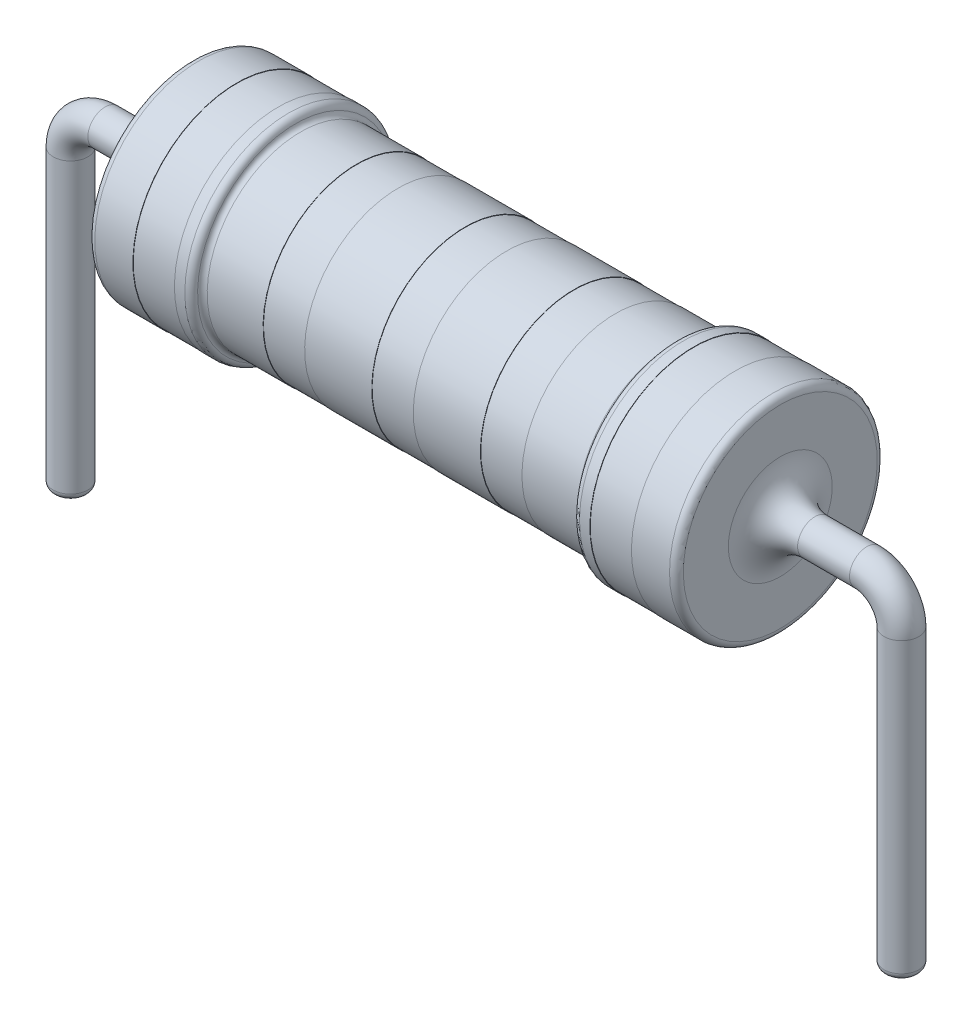
ISO-10303-21;
HEADER;
FILE_DESCRIPTION(('STEP AP214'),'2;1');
FILE_NAME('part.step','',(''),(''),'','','');
FILE_SCHEMA(('AUTOMOTIVE_DESIGN { 1 0 10303 214 1 1 1 1 }'));
ENDSEC;
DATA;
#1=APPLICATION_CONTEXT('core data for automotive mechanical design processes');
#2=APPLICATION_PROTOCOL_DEFINITION('international standard','automotive_design',2000,#1);
#3=PRODUCT_CONTEXT('',#1,'mechanical');
#4=PRODUCT('Part','Part','',(#3));
#5=PRODUCT_RELATED_PRODUCT_CATEGORY('part','',(#4));
#6=PRODUCT_DEFINITION_FORMATION('','',#4);
#7=PRODUCT_DEFINITION_CONTEXT('part definition',#1,'design');
#8=PRODUCT_DEFINITION('design','',#6,#7);
#9=PRODUCT_DEFINITION_SHAPE('','',#8);
#10=(LENGTH_UNIT() NAMED_UNIT(*) SI_UNIT(.MILLI.,.METRE.));
#11=(NAMED_UNIT(*) PLANE_ANGLE_UNIT() SI_UNIT($,.RADIAN.));
#12=(NAMED_UNIT(*) SI_UNIT($,.STERADIAN.) SOLID_ANGLE_UNIT());
#13=UNCERTAINTY_MEASURE_WITH_UNIT(LENGTH_MEASURE(1.E-05),#10,'distance_accuracy_value','');
#14=(GEOMETRIC_REPRESENTATION_CONTEXT(3) GLOBAL_UNCERTAINTY_ASSIGNED_CONTEXT((#13)) GLOBAL_UNIT_ASSIGNED_CONTEXT((#10,
#11,#12)) REPRESENTATION_CONTEXT('',''));
#15=CARTESIAN_POINT('',(0.,0.,0.));
#16=DIRECTION('',(0.,0.,1.));
#17=DIRECTION('',(1.,0.,0.));
#18=AXIS2_PLACEMENT_3D('',#15,#16,#17);
#19=CARTESIAN_POINT('',(8.5,0.,0.));
#20=DIRECTION('',(1.,0.,0.));
#21=DIRECTION('',(0.,1.,0.));
#22=AXIS2_PLACEMENT_3D('',#19,#20,#21);
#23=PLANE('',#22);
#24=CARTESIAN_POINT('',(8.5,0.,0.));
#25=DIRECTION('',(1.,0.,0.));
#26=DIRECTION('',(0.,1.,0.));
#27=AXIS2_PLACEMENT_3D('',#24,#25,#26);
#28=CIRCLE('',#27,1.5);
#29=CARTESIAN_POINT('',(8.5,1.5,0.));
#30=VERTEX_POINT('',#29);
#31=EDGE_CURVE('E60',#30,#30,#28,.F.);
#32=ORIENTED_EDGE('',*,*,#31,.T.);
#33=EDGE_LOOP('',(#32));
#34=FACE_BOUND('',#33,.T.);
#35=CARTESIAN_POINT('',(8.5,0.,0.));
#36=DIRECTION('',(1.,0.,0.));
#37=DIRECTION('',(0.,1.,0.));
#38=AXIS2_PLACEMENT_3D('',#35,#36,#37);
#39=CIRCLE('',#38,2.8);
#40=CARTESIAN_POINT('',(8.5,2.8,0.));
#41=VERTEX_POINT('',#40);
#42=EDGE_CURVE('E87',#41,#41,#39,.T.);
#43=ORIENTED_EDGE('',*,*,#42,.T.);
#44=EDGE_LOOP('',(#43));
#45=FACE_BOUND('',#44,.T.);
#46=ADVANCED_FACE('F34',(#34,#45),#23,.T.);
#47=CARTESIAN_POINT('',(-8.5,0.,0.));
#48=DIRECTION('',(-1.,0.,0.));
#49=DIRECTION('',(0.,-1.,0.));
#50=AXIS2_PLACEMENT_3D('',#47,#48,#49);
#51=CYLINDRICAL_SURFACE('',#50,3.);
#52=CARTESIAN_POINT('',(8.3,0.,0.));
#53=DIRECTION('',(1.,0.,0.));
#54=DIRECTION('',(0.,1.,0.));
#55=AXIS2_PLACEMENT_3D('',#52,#53,#54);
#56=CIRCLE('',#55,3.);
#57=CARTESIAN_POINT('',(8.3,3.,0.));
#58=VERTEX_POINT('',#57);
#59=EDGE_CURVE('E90',#58,#58,#56,.F.);
#60=ORIENTED_EDGE('',*,*,#59,.T.);
#61=EDGE_LOOP('',(#60));
#62=FACE_BOUND('',#61,.T.);
#63=CARTESIAN_POINT('',(7.2,0.,0.));
#64=DIRECTION('',(-1.,0.,0.));
#65=DIRECTION('',(0.,-1.,0.));
#66=AXIS2_PLACEMENT_3D('',#63,#64,#65);
#67=CIRCLE('',#66,3.);
#68=CARTESIAN_POINT('',(7.2,-3.,0.));
#69=VERTEX_POINT('',#68);
#70=EDGE_CURVE('E96',#69,#69,#67,.T.);
#71=ORIENTED_EDGE('',*,*,#70,.F.);
#72=EDGE_LOOP('',(#71));
#73=FACE_BOUND('',#72,.T.);
#74=ADVANCED_FACE('F188',(#62,#73),#51,.T.);
#75=CARTESIAN_POINT('',(7.2,-3.,0.));
#76=DIRECTION('',(-1.,0.,0.));
#77=DIRECTION('',(0.,-1.,0.));
#78=AXIS2_PLACEMENT_3D('',#75,#76,#77);
#79=PLANE('',#78);
#80=ORIENTED_EDGE('',*,*,#70,.T.);
#81=EDGE_LOOP('',(#80));
#82=FACE_BOUND('',#81,.T.);
#83=CARTESIAN_POINT('',(7.2,0.,0.));
#84=DIRECTION('',(-1.,0.,0.));
#85=DIRECTION('',(0.,-1.,0.));
#86=AXIS2_PLACEMENT_3D('',#83,#84,#85);
#87=CIRCLE('',#86,2.99);
#88=CARTESIAN_POINT('',(7.2,-2.99,0.));
#89=VERTEX_POINT('',#88);
#90=EDGE_CURVE('E99',#89,#89,#87,.T.);
#91=ORIENTED_EDGE('',*,*,#90,.F.);
#92=EDGE_LOOP('',(#91));
#93=FACE_BOUND('',#92,.T.);
#94=ADVANCED_FACE('F194',(#82,#93),#79,.T.);
#95=CARTESIAN_POINT('',(-8.5,0.,0.));
#96=DIRECTION('',(-1.,0.,0.));
#97=DIRECTION('',(0.,-1.,0.));
#98=AXIS2_PLACEMENT_3D('',#95,#96,#97);
#99=CYLINDRICAL_SURFACE('',#98,2.99);
#100=ORIENTED_EDGE('',*,*,#90,.T.);
#101=EDGE_LOOP('',(#100));
#102=FACE_BOUND('',#101,.T.);
#103=CARTESIAN_POINT('',(6.,0.,0.));
#104=DIRECTION('',(-1.,0.,0.));
#105=DIRECTION('',(0.,-1.,0.));
#106=AXIS2_PLACEMENT_3D('',#103,#104,#105);
#107=CIRCLE('',#106,2.99);
#108=CARTESIAN_POINT('',(6.,-2.99,0.));
#109=VERTEX_POINT('',#108);
#110=EDGE_CURVE('E102',#109,#109,#107,.T.);
#111=ORIENTED_EDGE('',*,*,#110,.F.);
#112=EDGE_LOOP('',(#111));
#113=FACE_BOUND('',#112,.T.);
#114=ADVANCED_FACE('F539',(#102,#113),#99,.T.);
#115=CARTESIAN_POINT('',(6.,-2.99,0.));
#116=DIRECTION('',(1.,0.,0.));
#117=DIRECTION('',(0.,1.,0.));
#118=AXIS2_PLACEMENT_3D('',#115,#116,#117);
#119=PLANE('',#118);
#120=ORIENTED_EDGE('',*,*,#110,.T.);
#121=EDGE_LOOP('',(#120));
#122=FACE_BOUND('',#121,.T.);
#123=CARTESIAN_POINT('',(6.,0.,0.));
#124=DIRECTION('',(-1.,0.,0.));
#125=DIRECTION('',(0.,-1.,0.));
#126=AXIS2_PLACEMENT_3D('',#123,#124,#125);
#127=CIRCLE('',#126,3.);
#128=CARTESIAN_POINT('',(6.,-3.,0.));
#129=VERTEX_POINT('',#128);
#130=EDGE_CURVE('E105',#129,#129,#127,.T.);
#131=ORIENTED_EDGE('',*,*,#130,.F.);
#132=EDGE_LOOP('',(#131));
#133=FACE_BOUND('',#132,.T.);
#134=ADVANCED_FACE('F543',(#122,#133),#119,.T.);
#135=CARTESIAN_POINT('',(-8.5,0.,0.));
#136=DIRECTION('',(-1.,0.,0.));
#137=DIRECTION('',(0.,-1.,0.));
#138=AXIS2_PLACEMENT_3D('',#135,#136,#137);
#139=CYLINDRICAL_SURFACE('',#138,3.);
#140=CARTESIAN_POINT('',(5.7,0.,0.));
#141=DIRECTION('',(-1.,0.,0.));
#142=DIRECTION('',(0.,-1.,0.));
#143=AXIS2_PLACEMENT_3D('',#140,#141,#142);
#144=CIRCLE('',#143,3.);
#145=CARTESIAN_POINT('',(5.7,-3.,0.));
#146=VERTEX_POINT('',#145);
#147=EDGE_CURVE('E93',#146,#146,#144,.F.);
#148=ORIENTED_EDGE('',*,*,#147,.T.);
#149=EDGE_LOOP('',(#148));
#150=FACE_BOUND('',#149,.T.);
#151=ORIENTED_EDGE('',*,*,#130,.T.);
#152=EDGE_LOOP('',(#151));
#153=FACE_BOUND('',#152,.T.);
#154=ADVANCED_FACE('F380',(#150,#153),#139,.T.);
#155=CARTESIAN_POINT('',(-8.5,0.,0.));
#156=DIRECTION('',(-1.,0.,0.));
#157=DIRECTION('',(0.,-1.,0.));
#158=AXIS2_PLACEMENT_3D('',#155,#156,#157);
#159=CYLINDRICAL_SURFACE('',#158,2.7);
#160=CARTESIAN_POINT('',(5.35358983848622,0.,0.));
#161=DIRECTION('',(-1.,0.,0.));
#162=DIRECTION('',(0.,-1.,0.));
#163=AXIS2_PLACEMENT_3D('',#160,#161,#162);
#164=CIRCLE('',#163,2.7);
#165=CARTESIAN_POINT('',(5.35358983848622,-2.7,0.));
#166=VERTEX_POINT('',#165);
#167=EDGE_CURVE('E69',#166,#166,#164,.T.);
#168=ORIENTED_EDGE('',*,*,#167,.T.);
#169=EDGE_LOOP('',(#168));
#170=FACE_BOUND('',#169,.T.);
#171=CARTESIAN_POINT('',(3.73802223615149,0.,0.));
#172=DIRECTION('',(-1.,0.,0.));
#173=DIRECTION('',(0.,-1.,0.));
#174=AXIS2_PLACEMENT_3D('',#171,#172,#173);
#175=CIRCLE('',#174,2.7);
#176=CARTESIAN_POINT('',(3.73802223615149,-2.7,0.));
#177=VERTEX_POINT('',#176);
#178=EDGE_CURVE('E108',#177,#177,#175,.T.);
#179=ORIENTED_EDGE('',*,*,#178,.F.);
#180=EDGE_LOOP('',(#179));
#181=FACE_BOUND('',#180,.T.);
#182=ADVANCED_FACE('F375',(#170,#181),#159,.T.);
#183=CARTESIAN_POINT('',(3.73802223615149,-2.7,0.));
#184=DIRECTION('',(-1.,0.,0.));
#185=DIRECTION('',(0.,-1.,0.));
#186=AXIS2_PLACEMENT_3D('',#183,#184,#185);
#187=PLANE('',#186);
#188=ORIENTED_EDGE('',*,*,#178,.T.);
#189=EDGE_LOOP('',(#188));
#190=FACE_BOUND('',#189,.T.);
#191=CARTESIAN_POINT('',(3.73802223615149,0.,0.));
#192=DIRECTION('',(-1.,0.,0.));
#193=DIRECTION('',(0.,-1.,0.));
#194=AXIS2_PLACEMENT_3D('',#191,#192,#193);
#195=CIRCLE('',#194,2.69);
#196=CARTESIAN_POINT('',(3.73802223615149,-2.69,0.));
#197=VERTEX_POINT('',#196);
#198=EDGE_CURVE('E111',#197,#197,#195,.T.);
#199=ORIENTED_EDGE('',*,*,#198,.F.);
#200=EDGE_LOOP('',(#199));
#201=FACE_BOUND('',#200,.T.);
#202=ADVANCED_FACE('F379',(#190,#201),#187,.T.);
#203=CARTESIAN_POINT('',(-8.5,0.,0.));
#204=DIRECTION('',(-1.,0.,0.));
#205=DIRECTION('',(0.,-1.,0.));
#206=AXIS2_PLACEMENT_3D('',#203,#204,#205);
#207=CYLINDRICAL_SURFACE('',#206,2.69);
#208=ORIENTED_EDGE('',*,*,#198,.T.);
#209=EDGE_LOOP('',(#208));
#210=FACE_BOUND('',#209,.T.);
#211=CARTESIAN_POINT('',(2.53802223615149,0.,0.));
#212=DIRECTION('',(-1.,0.,0.));
#213=DIRECTION('',(0.,-1.,0.));
#214=AXIS2_PLACEMENT_3D('',#211,#212,#213);
#215=CIRCLE('',#214,2.69);
#216=CARTESIAN_POINT('',(2.53802223615149,-2.69,0.));
#217=VERTEX_POINT('',#216);
#218=EDGE_CURVE('E114',#217,#217,#215,.T.);
#219=ORIENTED_EDGE('',*,*,#218,.F.);
#220=EDGE_LOOP('',(#219));
#221=FACE_BOUND('',#220,.T.);
#222=ADVANCED_FACE('F396',(#210,#221),#207,.T.);
#223=CARTESIAN_POINT('',(2.53802223615149,-2.69,0.));
#224=DIRECTION('',(1.,0.,0.));
#225=DIRECTION('',(0.,1.,0.));
#226=AXIS2_PLACEMENT_3D('',#223,#224,#225);
#227=PLANE('',#226);
#228=ORIENTED_EDGE('',*,*,#218,.T.);
#229=EDGE_LOOP('',(#228));
#230=FACE_BOUND('',#229,.T.);
#231=CARTESIAN_POINT('',(2.53802223615149,0.,0.));
#232=DIRECTION('',(-1.,0.,0.));
#233=DIRECTION('',(0.,-1.,0.));
#234=AXIS2_PLACEMENT_3D('',#231,#232,#233);
#235=CIRCLE('',#234,2.7);
#236=CARTESIAN_POINT('',(2.53802223615149,-2.7,0.));
#237=VERTEX_POINT('',#236);
#238=EDGE_CURVE('E117',#237,#237,#235,.T.);
#239=ORIENTED_EDGE('',*,*,#238,.F.);
#240=EDGE_LOOP('',(#239));
#241=FACE_BOUND('',#240,.T.);
#242=ADVANCED_FACE('F405',(#230,#241),#227,.T.);
#243=CARTESIAN_POINT('',(-8.5,0.,0.));
#244=DIRECTION('',(-1.,0.,0.));
#245=DIRECTION('',(0.,-1.,0.));
#246=AXIS2_PLACEMENT_3D('',#243,#244,#245);
#247=CYLINDRICAL_SURFACE('',#246,2.7);
#248=ORIENTED_EDGE('',*,*,#238,.T.);
#249=EDGE_LOOP('',(#248));
#250=FACE_BOUND('',#249,.T.);
#251=CARTESIAN_POINT('',(0.6,0.,0.));
#252=DIRECTION('',(-1.,0.,0.));
#253=DIRECTION('',(0.,-1.,0.));
#254=AXIS2_PLACEMENT_3D('',#251,#252,#253);
#255=CIRCLE('',#254,2.7);
#256=CARTESIAN_POINT('',(0.6,-2.7,0.));
#257=VERTEX_POINT('',#256);
#258=EDGE_CURVE('E120',#257,#257,#255,.T.);
#259=ORIENTED_EDGE('',*,*,#258,.F.);
#260=EDGE_LOOP('',(#259));
#261=FACE_BOUND('',#260,.T.);
#262=ADVANCED_FACE('F414',(#250,#261),#247,.T.);
#263=CARTESIAN_POINT('',(0.6,-2.7,0.));
#264=DIRECTION('',(-1.,0.,0.));
#265=DIRECTION('',(0.,-1.,0.));
#266=AXIS2_PLACEMENT_3D('',#263,#264,#265);
#267=PLANE('',#266);
#268=ORIENTED_EDGE('',*,*,#258,.T.);
#269=EDGE_LOOP('',(#268));
#270=FACE_BOUND('',#269,.T.);
#271=CARTESIAN_POINT('',(0.6,0.,0.));
#272=DIRECTION('',(-1.,0.,0.));
#273=DIRECTION('',(0.,-1.,0.));
#274=AXIS2_PLACEMENT_3D('',#271,#272,#273);
#275=CIRCLE('',#274,2.69);
#276=CARTESIAN_POINT('',(0.6,-2.69,0.));
#277=VERTEX_POINT('',#276);
#278=EDGE_CURVE('E123',#277,#277,#275,.T.);
#279=ORIENTED_EDGE('',*,*,#278,.F.);
#280=EDGE_LOOP('',(#279));
#281=FACE_BOUND('',#280,.T.);
#282=ADVANCED_FACE('F422',(#270,#281),#267,.T.);
#283=CARTESIAN_POINT('',(-8.5,0.,0.));
#284=DIRECTION('',(-1.,0.,0.));
#285=DIRECTION('',(0.,-1.,0.));
#286=AXIS2_PLACEMENT_3D('',#283,#284,#285);
#287=CYLINDRICAL_SURFACE('',#286,2.69);
#288=ORIENTED_EDGE('',*,*,#278,.T.);
#289=EDGE_LOOP('',(#288));
#290=FACE_BOUND('',#289,.T.);
#291=CARTESIAN_POINT('',(-0.6,0.,0.));
#292=DIRECTION('',(-1.,0.,0.));
#293=DIRECTION('',(0.,-1.,0.));
#294=AXIS2_PLACEMENT_3D('',#291,#292,#293);
#295=CIRCLE('',#294,2.69);
#296=CARTESIAN_POINT('',(-0.6,-2.69,0.));
#297=VERTEX_POINT('',#296);
#298=EDGE_CURVE('E126',#297,#297,#295,.T.);
#299=ORIENTED_EDGE('',*,*,#298,.F.);
#300=EDGE_LOOP('',(#299));
#301=FACE_BOUND('',#300,.T.);
#302=ADVANCED_FACE('F430',(#290,#301),#287,.T.);
#303=CARTESIAN_POINT('',(-0.6,-2.7,0.));
#304=DIRECTION('',(1.,0.,0.));
#305=DIRECTION('',(0.,1.,0.));
#306=AXIS2_PLACEMENT_3D('',#303,#304,#305);
#307=PLANE('',#306);
#308=ORIENTED_EDGE('',*,*,#298,.T.);
#309=EDGE_LOOP('',(#308));
#310=FACE_BOUND('',#309,.T.);
#311=CARTESIAN_POINT('',(-0.6,0.,0.));
#312=DIRECTION('',(-1.,0.,0.));
#313=DIRECTION('',(0.,-1.,0.));
#314=AXIS2_PLACEMENT_3D('',#311,#312,#313);
#315=CIRCLE('',#314,2.7);
#316=CARTESIAN_POINT('',(-0.6,-2.7,0.));
#317=VERTEX_POINT('',#316);
#318=EDGE_CURVE('E129',#317,#317,#315,.T.);
#319=ORIENTED_EDGE('',*,*,#318,.F.);
#320=EDGE_LOOP('',(#319));
#321=FACE_BOUND('',#320,.T.);
#322=ADVANCED_FACE('F438',(#310,#321),#307,.T.);
#323=CARTESIAN_POINT('',(-8.5,0.,0.));
#324=DIRECTION('',(-1.,0.,0.));
#325=DIRECTION('',(0.,-1.,0.));
#326=AXIS2_PLACEMENT_3D('',#323,#324,#325);
#327=CYLINDRICAL_SURFACE('',#326,2.7);
#328=ORIENTED_EDGE('',*,*,#318,.T.);
#329=EDGE_LOOP('',(#328));
#330=FACE_BOUND('',#329,.T.);
#331=CARTESIAN_POINT('',(-2.53802223615149,0.,0.));
#332=DIRECTION('',(-1.,0.,0.));
#333=DIRECTION('',(0.,-1.,0.));
#334=AXIS2_PLACEMENT_3D('',#331,#332,#333);
#335=CIRCLE('',#334,2.7);
#336=CARTESIAN_POINT('',(-2.53802223615149,-2.7,0.));
#337=VERTEX_POINT('',#336);
#338=EDGE_CURVE('E132',#337,#337,#335,.T.);
#339=ORIENTED_EDGE('',*,*,#338,.F.);
#340=EDGE_LOOP('',(#339));
#341=FACE_BOUND('',#340,.T.);
#342=ADVANCED_FACE('F446',(#330,#341),#327,.T.);
#343=CARTESIAN_POINT('',(-2.53802223615149,-2.69,0.));
#344=DIRECTION('',(-1.,0.,0.));
#345=DIRECTION('',(0.,-1.,0.));
#346=AXIS2_PLACEMENT_3D('',#343,#344,#345);
#347=PLANE('',#346);
#348=ORIENTED_EDGE('',*,*,#338,.T.);
#349=EDGE_LOOP('',(#348));
#350=FACE_BOUND('',#349,.T.);
#351=CARTESIAN_POINT('',(-2.53802223615149,0.,0.));
#352=DIRECTION('',(-1.,0.,0.));
#353=DIRECTION('',(0.,-1.,0.));
#354=AXIS2_PLACEMENT_3D('',#351,#352,#353);
#355=CIRCLE('',#354,2.69);
#356=CARTESIAN_POINT('',(-2.53802223615149,-2.69,0.));
#357=VERTEX_POINT('',#356);
#358=EDGE_CURVE('E135',#357,#357,#355,.T.);
#359=ORIENTED_EDGE('',*,*,#358,.F.);
#360=EDGE_LOOP('',(#359));
#361=FACE_BOUND('',#360,.T.);
#362=ADVANCED_FACE('F454',(#350,#361),#347,.T.);
#363=CARTESIAN_POINT('',(-8.5,0.,0.));
#364=DIRECTION('',(-1.,0.,0.));
#365=DIRECTION('',(0.,-1.,0.));
#366=AXIS2_PLACEMENT_3D('',#363,#364,#365);
#367=CYLINDRICAL_SURFACE('',#366,2.69);
#368=ORIENTED_EDGE('',*,*,#358,.T.);
#369=EDGE_LOOP('',(#368));
#370=FACE_BOUND('',#369,.T.);
#371=CARTESIAN_POINT('',(-3.73802223615149,0.,0.));
#372=DIRECTION('',(-1.,0.,0.));
#373=DIRECTION('',(0.,-1.,0.));
#374=AXIS2_PLACEMENT_3D('',#371,#372,#373);
#375=CIRCLE('',#374,2.69);
#376=CARTESIAN_POINT('',(-3.73802223615149,-2.69,0.));
#377=VERTEX_POINT('',#376);
#378=EDGE_CURVE('E138',#377,#377,#375,.T.);
#379=ORIENTED_EDGE('',*,*,#378,.F.);
#380=EDGE_LOOP('',(#379));
#381=FACE_BOUND('',#380,.T.);
#382=ADVANCED_FACE('F462',(#370,#381),#367,.T.);
#383=CARTESIAN_POINT('',(-3.73802223615149,-2.7,0.));
#384=DIRECTION('',(1.,0.,0.));
#385=DIRECTION('',(0.,1.,0.));
#386=AXIS2_PLACEMENT_3D('',#383,#384,#385);
#387=PLANE('',#386);
#388=ORIENTED_EDGE('',*,*,#378,.T.);
#389=EDGE_LOOP('',(#388));
#390=FACE_BOUND('',#389,.T.);
#391=CARTESIAN_POINT('',(-3.73802223615149,0.,0.));
#392=DIRECTION('',(-1.,0.,0.));
#393=DIRECTION('',(0.,-1.,0.));
#394=AXIS2_PLACEMENT_3D('',#391,#392,#393);
#395=CIRCLE('',#394,2.7);
#396=CARTESIAN_POINT('',(-3.73802223615149,-2.7,0.));
#397=VERTEX_POINT('',#396);
#398=EDGE_CURVE('E141',#397,#397,#395,.T.);
#399=ORIENTED_EDGE('',*,*,#398,.F.);
#400=EDGE_LOOP('',(#399));
#401=FACE_BOUND('',#400,.T.);
#402=ADVANCED_FACE('F365',(#390,#401),#387,.T.);
#403=CARTESIAN_POINT('',(-8.5,0.,0.));
#404=DIRECTION('',(-1.,0.,0.));
#405=DIRECTION('',(0.,-1.,0.));
#406=AXIS2_PLACEMENT_3D('',#403,#404,#405);
#407=CYLINDRICAL_SURFACE('',#406,2.7);
#408=CARTESIAN_POINT('',(-5.35358983848623,0.,0.));
#409=DIRECTION('',(-1.,0.,0.));
#410=DIRECTION('',(0.,-1.,0.));
#411=AXIS2_PLACEMENT_3D('',#408,#409,#410);
#412=CIRCLE('',#411,2.7);
#413=CARTESIAN_POINT('',(-5.35358983848623,-2.7,0.));
#414=VERTEX_POINT('',#413);
#415=EDGE_CURVE('E72',#414,#414,#412,.F.);
#416=ORIENTED_EDGE('',*,*,#415,.T.);
#417=EDGE_LOOP('',(#416));
#418=FACE_BOUND('',#417,.T.);
#419=ORIENTED_EDGE('',*,*,#398,.T.);
#420=EDGE_LOOP('',(#419));
#421=FACE_BOUND('',#420,.T.);
#422=ADVANCED_FACE('F360',(#418,#421),#407,.T.);
#423=CARTESIAN_POINT('',(-8.5,0.,0.));
#424=DIRECTION('',(-1.,0.,0.));
#425=DIRECTION('',(0.,-1.,0.));
#426=AXIS2_PLACEMENT_3D('',#423,#424,#425);
#427=CYLINDRICAL_SURFACE('',#426,3.);
#428=CARTESIAN_POINT('',(-5.7,0.,0.));
#429=DIRECTION('',(1.,0.,0.));
#430=DIRECTION('',(0.,1.,0.));
#431=AXIS2_PLACEMENT_3D('',#428,#429,#430);
#432=CIRCLE('',#431,3.);
#433=CARTESIAN_POINT('',(-5.7,3.,0.));
#434=VERTEX_POINT('',#433);
#435=EDGE_CURVE('E84',#434,#434,#432,.F.);
#436=ORIENTED_EDGE('',*,*,#435,.T.);
#437=EDGE_LOOP('',(#436));
#438=FACE_BOUND('',#437,.T.);
#439=CARTESIAN_POINT('',(-6.,0.,0.));
#440=DIRECTION('',(-1.,0.,0.));
#441=DIRECTION('',(0.,-1.,0.));
#442=AXIS2_PLACEMENT_3D('',#439,#440,#441);
#443=CIRCLE('',#442,3.);
#444=CARTESIAN_POINT('',(-6.,-3.,0.));
#445=VERTEX_POINT('',#444);
#446=EDGE_CURVE('E144',#445,#445,#443,.T.);
#447=ORIENTED_EDGE('',*,*,#446,.F.);
#448=EDGE_LOOP('',(#447));
#449=FACE_BOUND('',#448,.T.);
#450=ADVANCED_FACE('F364',(#438,#449),#427,.T.);
#451=CARTESIAN_POINT('',(-6.,-2.99,0.));
#452=DIRECTION('',(-1.,0.,0.));
#453=DIRECTION('',(0.,-1.,0.));
#454=AXIS2_PLACEMENT_3D('',#451,#452,#453);
#455=PLANE('',#454);
#456=ORIENTED_EDGE('',*,*,#446,.T.);
#457=EDGE_LOOP('',(#456));
#458=FACE_BOUND('',#457,.T.);
#459=CARTESIAN_POINT('',(-6.,0.,0.));
#460=DIRECTION('',(-1.,0.,0.));
#461=DIRECTION('',(0.,-1.,0.));
#462=AXIS2_PLACEMENT_3D('',#459,#460,#461);
#463=CIRCLE('',#462,2.99);
#464=CARTESIAN_POINT('',(-6.,-2.99,0.));
#465=VERTEX_POINT('',#464);
#466=EDGE_CURVE('E147',#465,#465,#463,.T.);
#467=ORIENTED_EDGE('',*,*,#466,.F.);
#468=EDGE_LOOP('',(#467));
#469=FACE_BOUND('',#468,.T.);
#470=ADVANCED_FACE('F483',(#458,#469),#455,.T.);
#471=CARTESIAN_POINT('',(-8.5,0.,0.));
#472=DIRECTION('',(-1.,0.,0.));
#473=DIRECTION('',(0.,-1.,0.));
#474=AXIS2_PLACEMENT_3D('',#471,#472,#473);
#475=CYLINDRICAL_SURFACE('',#474,2.99);
#476=ORIENTED_EDGE('',*,*,#466,.T.);
#477=EDGE_LOOP('',(#476));
#478=FACE_BOUND('',#477,.T.);
#479=CARTESIAN_POINT('',(-7.2,0.,0.));
#480=DIRECTION('',(-1.,0.,0.));
#481=DIRECTION('',(0.,-1.,0.));
#482=AXIS2_PLACEMENT_3D('',#479,#480,#481);
#483=CIRCLE('',#482,2.99);
#484=CARTESIAN_POINT('',(-7.2,-2.99,0.));
#485=VERTEX_POINT('',#484);
#486=EDGE_CURVE('E150',#485,#485,#483,.T.);
#487=ORIENTED_EDGE('',*,*,#486,.F.);
#488=EDGE_LOOP('',(#487));
#489=FACE_BOUND('',#488,.T.);
#490=ADVANCED_FACE('F488',(#478,#489),#475,.T.);
#491=CARTESIAN_POINT('',(-7.2,-3.,0.));
#492=DIRECTION('',(1.,0.,0.));
#493=DIRECTION('',(0.,1.,0.));
#494=AXIS2_PLACEMENT_3D('',#491,#492,#493);
#495=PLANE('',#494);
#496=ORIENTED_EDGE('',*,*,#486,.T.);
#497=EDGE_LOOP('',(#496));
#498=FACE_BOUND('',#497,.T.);
#499=CARTESIAN_POINT('',(-7.2,0.,0.));
#500=DIRECTION('',(-1.,0.,0.));
#501=DIRECTION('',(0.,-1.,0.));
#502=AXIS2_PLACEMENT_3D('',#499,#500,#501);
#503=CIRCLE('',#502,3.);
#504=CARTESIAN_POINT('',(-7.2,-3.,0.));
#505=VERTEX_POINT('',#504);
#506=EDGE_CURVE('E153',#505,#505,#503,.T.);
#507=ORIENTED_EDGE('',*,*,#506,.F.);
#508=EDGE_LOOP('',(#507));
#509=FACE_BOUND('',#508,.T.);
#510=ADVANCED_FACE('F498',(#498,#509),#495,.T.);
#511=CARTESIAN_POINT('',(-8.5,0.,0.));
#512=DIRECTION('',(-1.,0.,0.));
#513=DIRECTION('',(0.,-1.,0.));
#514=AXIS2_PLACEMENT_3D('',#511,#512,#513);
#515=CYLINDRICAL_SURFACE('',#514,3.);
#516=CARTESIAN_POINT('',(-8.3,0.,0.));
#517=DIRECTION('',(-1.,0.,0.));
#518=DIRECTION('',(0.,-1.,0.));
#519=AXIS2_PLACEMENT_3D('',#516,#517,#518);
#520=CIRCLE('',#519,3.);
#521=CARTESIAN_POINT('',(-8.3,-3.,0.));
#522=VERTEX_POINT('',#521);
#523=EDGE_CURVE('E78',#522,#522,#520,.F.);
#524=ORIENTED_EDGE('',*,*,#523,.T.);
#525=EDGE_LOOP('',(#524));
#526=FACE_BOUND('',#525,.T.);
#527=ORIENTED_EDGE('',*,*,#506,.T.);
#528=EDGE_LOOP('',(#527));
#529=FACE_BOUND('',#528,.T.);
#530=ADVANCED_FACE('F508',(#526,#529),#515,.T.);
#531=CARTESIAN_POINT('',(-8.5,0.,0.));
#532=DIRECTION('',(-1.,0.,0.));
#533=DIRECTION('',(0.,-1.,0.));
#534=AXIS2_PLACEMENT_3D('',#531,#532,#533);
#535=PLANE('',#534);
#536=CARTESIAN_POINT('',(-8.5,0.,0.));
#537=DIRECTION('',(-1.,0.,0.));
#538=DIRECTION('',(0.,-1.,0.));
#539=AXIS2_PLACEMENT_3D('',#536,#537,#538);
#540=CIRCLE('',#539,1.5);
#541=CARTESIAN_POINT('',(-8.5,-1.5,0.));
#542=VERTEX_POINT('',#541);
#543=EDGE_CURVE('E54',#542,#542,#540,.F.);
#544=ORIENTED_EDGE('',*,*,#543,.T.);
#545=EDGE_LOOP('',(#544));
#546=FACE_BOUND('',#545,.T.);
#547=CARTESIAN_POINT('',(-8.5,0.,0.));
#548=DIRECTION('',(-1.,0.,0.));
#549=DIRECTION('',(0.,-1.,0.));
#550=AXIS2_PLACEMENT_3D('',#547,#548,#549);
#551=CIRCLE('',#550,2.8);
#552=CARTESIAN_POINT('',(-8.5,-2.8,0.));
#553=VERTEX_POINT('',#552);
#554=EDGE_CURVE('E81',#553,#553,#551,.T.);
#555=ORIENTED_EDGE('',*,*,#554,.T.);
#556=EDGE_LOOP('',(#555));
#557=FACE_BOUND('',#556,.T.);
#558=ADVANCED_FACE('F291',(#546,#557),#535,.T.);
#559=CARTESIAN_POINT('',(12.,-0.999999999999999,0.));
#560=DIRECTION('',(0.,-1.,0.));
#561=DIRECTION('',(0.,0.,-1.));
#562=AXIS2_PLACEMENT_3D('',#559,#560,#561);
#563=CYLINDRICAL_SURFACE('',#562,0.5);
#564=CARTESIAN_POINT('',(12.,-9.33298619909469,0.));
#565=DIRECTION('',(0.,-1.,0.));
#566=DIRECTION('',(1.,0.,0.));
#567=AXIS2_PLACEMENT_3D('',#564,#565,#566);
#568=CIRCLE('',#567,0.5);
#569=CARTESIAN_POINT('',(12.5,-9.33298619909468,0.));
#570=VERTEX_POINT('',#569);
#571=EDGE_CURVE('E10',#570,#570,#568,.F.);
#572=ORIENTED_EDGE('',*,*,#571,.T.);
#573=EDGE_LOOP('',(#572));
#574=FACE_BOUND('',#573,.T.);
#575=CARTESIAN_POINT('',(12.,-0.999999999999999,0.));
#576=DIRECTION('',(0.,-1.,0.));
#577=DIRECTION('',(1.,0.,0.));
#578=AXIS2_PLACEMENT_3D('',#575,#576,#577);
#579=CIRCLE('',#578,0.5);
#580=CARTESIAN_POINT('',(12.5,-0.999999999999999,0.));
#581=VERTEX_POINT('',#580);
#582=EDGE_CURVE('E156',#581,#581,#579,.T.);
#583=ORIENTED_EDGE('',*,*,#582,.T.);
#584=EDGE_LOOP('',(#583));
#585=FACE_BOUND('',#584,.T.);
#586=ADVANCED_FACE('F286',(#574,#585),#563,.T.);
#587=CARTESIAN_POINT('',(11.,-1.,0.));
#588=DIRECTION('',(0.,0.,-1.));
#589=DIRECTION('',(-1.,0.,0.));
#590=AXIS2_PLACEMENT_3D('',#587,#588,#589);
#591=TOROIDAL_SURFACE('',#590,1.,0.5);
#592=CARTESIAN_POINT('',(11.,0.,0.));
#593=DIRECTION('',(1.,0.,0.));
#594=DIRECTION('',(0.,1.,0.));
#595=AXIS2_PLACEMENT_3D('',#592,#593,#594);
#596=CIRCLE('',#595,0.5);
#597=CARTESIAN_POINT('',(11.,0.5,0.));
#598=VERTEX_POINT('',#597);
#599=EDGE_CURVE('E159',#598,#598,#596,.T.);
#600=CARTESIAN_POINT('',(11.,-1.,0.));
#601=DIRECTION('',(0.,0.,-1.));
#602=DIRECTION('',(-1.,0.,0.));
#603=AXIS2_PLACEMENT_3D('',#600,#601,#602);
#604=CIRCLE('',#603,1.5);
#605=EDGE_CURVE('',#598,#581,#604,.T.);
#606=ORIENTED_EDGE('',*,*,#599,.T.);
#607=ORIENTED_EDGE('',*,*,#582,.F.);
#608=ORIENTED_EDGE('',*,*,#605,.T.);
#609=ORIENTED_EDGE('',*,*,#605,.F.);
#610=EDGE_LOOP('',(#606,#608,#607,#609));
#611=FACE_BOUND('',#610,.T.);
#612=ADVANCED_FACE('F267',(#611),#591,.T.);
#613=CARTESIAN_POINT('',(11.,0.,0.));
#614=DIRECTION('',(-1.,0.,0.));
#615=DIRECTION('',(0.,-1.,0.));
#616=AXIS2_PLACEMENT_3D('',#613,#614,#615);
#617=CYLINDRICAL_SURFACE('',#616,0.5);
#618=CARTESIAN_POINT('',(9.5,0.,0.));
#619=DIRECTION('',(1.,0.,0.));
#620=DIRECTION('',(0.,1.,0.));
#621=AXIS2_PLACEMENT_3D('',#618,#619,#620);
#622=CIRCLE('',#621,0.5);
#623=CARTESIAN_POINT('',(9.5,0.5,0.));
#624=VERTEX_POINT('',#623);
#625=EDGE_CURVE('E63',#624,#624,#622,.T.);
#626=ORIENTED_EDGE('',*,*,#625,.T.);
#627=EDGE_LOOP('',(#626));
#628=FACE_BOUND('',#627,.T.);
#629=ORIENTED_EDGE('',*,*,#599,.F.);
#630=EDGE_LOOP('',(#629));
#631=FACE_BOUND('',#630,.T.);
#632=ADVANCED_FACE('F185',(#628,#631),#617,.T.);
#633=CARTESIAN_POINT('',(12.,-9.53298619909468,0.));
#634=DIRECTION('',(0.,-1.,0.));
#635=DIRECTION('',(1.,0.,0.));
#636=AXIS2_PLACEMENT_3D('',#633,#634,#635);
#637=PLANE('',#636);
#638=CARTESIAN_POINT('',(12.,-9.53298619909468,0.));
#639=DIRECTION('',(0.,-1.,0.));
#640=DIRECTION('',(1.,0.,0.));
#641=AXIS2_PLACEMENT_3D('',#638,#639,#640);
#642=CIRCLE('',#641,0.3);
#643=CARTESIAN_POINT('',(12.3,-9.53298619909468,0.));
#644=VERTEX_POINT('',#643);
#645=EDGE_CURVE('E41',#644,#644,#642,.T.);
#646=ORIENTED_EDGE('',*,*,#645,.T.);
#647=EDGE_LOOP('',(#646));
#648=FACE_BOUND('',#647,.T.);
#649=ADVANCED_FACE('F179',(#648),#637,.T.);
#650=CARTESIAN_POINT('',(-12.,-0.999999999999999,0.));
#651=DIRECTION('',(0.,-1.,0.));
#652=DIRECTION('',(0.,0.,-1.));
#653=AXIS2_PLACEMENT_3D('',#650,#651,#652);
#654=CYLINDRICAL_SURFACE('',#653,0.5);
#655=CARTESIAN_POINT('',(-12.,-9.33298619909469,0.));
#656=DIRECTION('',(0.,-1.,0.));
#657=DIRECTION('',(1.,0.,0.));
#658=AXIS2_PLACEMENT_3D('',#655,#656,#657);
#659=CIRCLE('',#658,0.5);
#660=CARTESIAN_POINT('',(-11.5,-9.33298619909469,0.));
#661=VERTEX_POINT('',#660);
#662=EDGE_CURVE('E49',#661,#661,#659,.F.);
#663=ORIENTED_EDGE('',*,*,#662,.T.);
#664=EDGE_LOOP('',(#663));
#665=FACE_BOUND('',#664,.T.);
#666=CARTESIAN_POINT('',(-12.,-0.999999999999999,0.));
#667=DIRECTION('',(0.,1.,0.));
#668=DIRECTION('',(-1.,0.,0.));
#669=AXIS2_PLACEMENT_3D('',#666,#667,#668);
#670=CIRCLE('',#669,0.5);
#671=CARTESIAN_POINT('',(-12.5,-0.999999999999999,0.));
#672=VERTEX_POINT('',#671);
#673=EDGE_CURVE('E162',#672,#672,#670,.T.);
#674=ORIENTED_EDGE('',*,*,#673,.F.);
#675=EDGE_LOOP('',(#674));
#676=FACE_BOUND('',#675,.T.);
#677=ADVANCED_FACE('F174',(#665,#676),#654,.T.);
#678=CARTESIAN_POINT('',(-11.,-1.,0.));
#679=DIRECTION('',(0.,0.,1.));
#680=DIRECTION('',(1.,0.,0.));
#681=AXIS2_PLACEMENT_3D('',#678,#679,#680);
#682=TOROIDAL_SURFACE('',#681,1.,0.5);
#683=CARTESIAN_POINT('',(-11.,0.,0.));
#684=DIRECTION('',(1.,0.,0.));
#685=DIRECTION('',(0.,1.,0.));
#686=AXIS2_PLACEMENT_3D('',#683,#684,#685);
#687=CIRCLE('',#686,0.5);
#688=CARTESIAN_POINT('',(-11.,0.5,0.));
#689=VERTEX_POINT('',#688);
#690=EDGE_CURVE('E165',#689,#689,#687,.T.);
#691=CARTESIAN_POINT('',(-11.,-1.,0.));
#692=DIRECTION('',(0.,0.,1.));
#693=DIRECTION('',(1.,0.,0.));
#694=AXIS2_PLACEMENT_3D('',#691,#692,#693);
#695=CIRCLE('',#694,1.5);
#696=EDGE_CURVE('',#689,#672,#695,.T.);
#697=ORIENTED_EDGE('',*,*,#690,.F.);
#698=ORIENTED_EDGE('',*,*,#673,.T.);
#699=ORIENTED_EDGE('',*,*,#696,.T.);
#700=ORIENTED_EDGE('',*,*,#696,.F.);
#701=EDGE_LOOP('',(#697,#699,#698,#700));
#702=FACE_BOUND('',#701,.T.);
#703=ADVANCED_FACE('F171',(#702),#682,.T.);
#704=CARTESIAN_POINT('',(-11.,0.,0.));
#705=DIRECTION('',(1.,0.,0.));
#706=DIRECTION('',(0.,1.,0.));
#707=AXIS2_PLACEMENT_3D('',#704,#705,#706);
#708=CYLINDRICAL_SURFACE('',#707,0.5);
#709=CARTESIAN_POINT('',(-9.5,0.,0.));
#710=DIRECTION('',(-1.,0.,0.));
#711=DIRECTION('',(0.,-1.,0.));
#712=AXIS2_PLACEMENT_3D('',#709,#710,#711);
#713=CIRCLE('',#712,0.5);
#714=CARTESIAN_POINT('',(-9.5,-0.5,0.));
#715=VERTEX_POINT('',#714);
#716=EDGE_CURVE('E57',#715,#715,#713,.T.);
#717=ORIENTED_EDGE('',*,*,#716,.T.);
#718=EDGE_LOOP('',(#717));
#719=FACE_BOUND('',#718,.T.);
#720=ORIENTED_EDGE('',*,*,#690,.T.);
#721=EDGE_LOOP('',(#720));
#722=FACE_BOUND('',#721,.T.);
#723=ADVANCED_FACE('F169',(#719,#722),#708,.T.);
#724=CARTESIAN_POINT('',(-12.,-9.53298619909468,0.));
#725=DIRECTION('',(0.,-1.,0.));
#726=DIRECTION('',(-1.,0.,0.));
#727=AXIS2_PLACEMENT_3D('',#724,#725,#726);
#728=PLANE('',#727);
#729=CARTESIAN_POINT('',(-12.,-9.53298619909468,0.));
#730=DIRECTION('',(0.,-1.,0.));
#731=DIRECTION('',(1.,0.,0.));
#732=AXIS2_PLACEMENT_3D('',#729,#730,#731);
#733=CIRCLE('',#732,0.3);
#734=CARTESIAN_POINT('',(-11.7,-9.53298619909468,0.));
#735=VERTEX_POINT('',#734);
#736=EDGE_CURVE('E45',#735,#735,#733,.T.);
#737=ORIENTED_EDGE('',*,*,#736,.T.);
#738=EDGE_LOOP('',(#737));
#739=FACE_BOUND('',#738,.T.);
#740=ADVANCED_FACE('F204',(#739),#728,.T.);
#741=CARTESIAN_POINT('',(5.7,0.,0.));
#742=DIRECTION('',(-1.,0.,0.));
#743=DIRECTION('',(0.,-1.,0.));
#744=AXIS2_PLACEMENT_3D('',#741,#742,#743);
#745=TOROIDAL_SURFACE('',#744,2.8,0.2);
#746=CARTESIAN_POINT('',(5.50205133627764,0.,0.));
#747=DIRECTION('',(1.,0.,0.));
#748=DIRECTION('',(0.,1.,0.));
#749=AXIS2_PLACEMENT_3D('',#746,#747,#748);
#750=CIRCLE('',#749,2.82857142857146);
#751=CARTESIAN_POINT('',(5.50205133627764,2.82857142857146,0.));
#752=VERTEX_POINT('',#751);
#753=EDGE_CURVE('E66',#752,#752,#750,.T.);
#754=ORIENTED_EDGE('',*,*,#753,.T.);
#755=EDGE_LOOP('',(#754));
#756=FACE_BOUND('',#755,.T.);
#757=ORIENTED_EDGE('',*,*,#147,.F.);
#758=EDGE_LOOP('',(#757));
#759=FACE_BOUND('',#758,.T.);
#760=ADVANCED_FACE('F200',(#756,#759),#745,.T.);
#761=CARTESIAN_POINT('',(8.3,0.,0.));
#762=DIRECTION('',(1.,0.,0.));
#763=DIRECTION('',(0.,1.,0.));
#764=AXIS2_PLACEMENT_3D('',#761,#762,#763);
#765=TOROIDAL_SURFACE('',#764,2.8,0.2);
#766=ORIENTED_EDGE('',*,*,#42,.F.);
#767=EDGE_LOOP('',(#766));
#768=FACE_BOUND('',#767,.T.);
#769=ORIENTED_EDGE('',*,*,#59,.F.);
#770=EDGE_LOOP('',(#769));
#771=FACE_BOUND('',#770,.T.);
#772=ADVANCED_FACE('F203',(#768,#771),#765,.T.);
#773=CARTESIAN_POINT('',(-5.7,0.,0.));
#774=DIRECTION('',(1.,0.,0.));
#775=DIRECTION('',(0.,1.,0.));
#776=AXIS2_PLACEMENT_3D('',#773,#774,#775);
#777=TOROIDAL_SURFACE('',#776,2.8,0.2);
#778=CARTESIAN_POINT('',(-5.50205133627827,0.,0.));
#779=DIRECTION('',(-1.,0.,0.));
#780=DIRECTION('',(0.,-1.,0.));
#781=AXIS2_PLACEMENT_3D('',#778,#779,#780);
#782=CIRCLE('',#781,2.82857142857137);
#783=CARTESIAN_POINT('',(-5.50205133627827,-2.82857142857137,0.));
#784=VERTEX_POINT('',#783);
#785=EDGE_CURVE('E75',#784,#784,#782,.T.);
#786=ORIENTED_EDGE('',*,*,#785,.T.);
#787=EDGE_LOOP('',(#786));
#788=FACE_BOUND('',#787,.T.);
#789=ORIENTED_EDGE('',*,*,#435,.F.);
#790=EDGE_LOOP('',(#789));
#791=FACE_BOUND('',#790,.T.);
#792=ADVANCED_FACE('F208',(#788,#791),#777,.T.);
#793=CARTESIAN_POINT('',(-8.3,0.,0.));
#794=DIRECTION('',(-1.,0.,0.));
#795=DIRECTION('',(0.,-1.,0.));
#796=AXIS2_PLACEMENT_3D('',#793,#794,#795);
#797=TOROIDAL_SURFACE('',#796,2.8,0.2);
#798=ORIENTED_EDGE('',*,*,#523,.F.);
#799=EDGE_LOOP('',(#798));
#800=FACE_BOUND('',#799,.T.);
#801=ORIENTED_EDGE('',*,*,#554,.F.);
#802=EDGE_LOOP('',(#801));
#803=FACE_BOUND('',#802,.T.);
#804=ADVANCED_FACE('F212',(#800,#803),#797,.T.);
#805=CARTESIAN_POINT('',(-5.35358983848623,0.,0.));
#806=DIRECTION('',(-1.,0.,0.));
#807=DIRECTION('',(0.,-1.,0.));
#808=AXIS2_PLACEMENT_3D('',#805,#806,#807);
#809=TOROIDAL_SURFACE('',#808,2.85,0.15);
#810=ORIENTED_EDGE('',*,*,#415,.F.);
#811=EDGE_LOOP('',(#810));
#812=FACE_BOUND('',#811,.T.);
#813=ORIENTED_EDGE('',*,*,#785,.F.);
#814=EDGE_LOOP('',(#813));
#815=FACE_BOUND('',#814,.T.);
#816=ADVANCED_FACE('F216',(#812,#815),#809,.F.);
#817=CARTESIAN_POINT('',(5.35358983848622,0.,0.));
#818=DIRECTION('',(-1.,0.,0.));
#819=DIRECTION('',(0.,-1.,0.));
#820=AXIS2_PLACEMENT_3D('',#817,#818,#819);
#821=TOROIDAL_SURFACE('',#820,2.85,0.15);
#822=ORIENTED_EDGE('',*,*,#753,.F.);
#823=EDGE_LOOP('',(#822));
#824=FACE_BOUND('',#823,.T.);
#825=ORIENTED_EDGE('',*,*,#167,.F.);
#826=EDGE_LOOP('',(#825));
#827=FACE_BOUND('',#826,.T.);
#828=ADVANCED_FACE('F220',(#824,#827),#821,.F.);
#829=CARTESIAN_POINT('',(9.5,0.,0.));
#830=DIRECTION('',(1.,0.,0.));
#831=DIRECTION('',(0.,1.,0.));
#832=AXIS2_PLACEMENT_3D('',#829,#830,#831);
#833=TOROIDAL_SURFACE('',#832,1.5,1.);
#834=ORIENTED_EDGE('',*,*,#31,.F.);
#835=EDGE_LOOP('',(#834));
#836=FACE_BOUND('',#835,.T.);
#837=ORIENTED_EDGE('',*,*,#625,.F.);
#838=EDGE_LOOP('',(#837));
#839=FACE_BOUND('',#838,.T.);
#840=ADVANCED_FACE('F224',(#836,#839),#833,.F.);
#841=CARTESIAN_POINT('',(-9.5,0.,0.));
#842=DIRECTION('',(-1.,0.,0.));
#843=DIRECTION('',(0.,-1.,0.));
#844=AXIS2_PLACEMENT_3D('',#841,#842,#843);
#845=TOROIDAL_SURFACE('',#844,1.5,1.);
#846=ORIENTED_EDGE('',*,*,#543,.F.);
#847=EDGE_LOOP('',(#846));
#848=FACE_BOUND('',#847,.T.);
#849=ORIENTED_EDGE('',*,*,#716,.F.);
#850=EDGE_LOOP('',(#849));
#851=FACE_BOUND('',#850,.T.);
#852=ADVANCED_FACE('F228',(#848,#851),#845,.F.);
#853=CARTESIAN_POINT('',(-12.,-9.33298619909469,0.));
#854=DIRECTION('',(0.,-1.,0.));
#855=DIRECTION('',(1.,0.,0.));
#856=AXIS2_PLACEMENT_3D('',#853,#854,#855);
#857=TOROIDAL_SURFACE('',#856,0.3,0.2);
#858=ORIENTED_EDGE('',*,*,#736,.F.);
#859=EDGE_LOOP('',(#858));
#860=FACE_BOUND('',#859,.T.);
#861=ORIENTED_EDGE('',*,*,#662,.F.);
#862=EDGE_LOOP('',(#861));
#863=FACE_BOUND('',#862,.T.);
#864=ADVANCED_FACE('F231',(#860,#863),#857,.T.);
#865=CARTESIAN_POINT('',(12.,-9.33298619909469,0.));
#866=DIRECTION('',(0.,-1.,0.));
#867=DIRECTION('',(1.,0.,0.));
#868=AXIS2_PLACEMENT_3D('',#865,#866,#867);
#869=TOROIDAL_SURFACE('',#868,0.3,0.2);
#870=ORIENTED_EDGE('',*,*,#571,.F.);
#871=EDGE_LOOP('',(#870));
#872=FACE_BOUND('',#871,.T.);
#873=ORIENTED_EDGE('',*,*,#645,.F.);
#874=EDGE_LOOP('',(#873));
#875=FACE_BOUND('',#874,.T.);
#876=ADVANCED_FACE('F36',(#872,#875),#869,.T.);
#877=CLOSED_SHELL('',(#46,#74,#94,#114,#134,#154,#182,#202,#222,#242,#262,#282,#302,#322,#342,
#362,#382,#402,#422,#450,#470,#490,#510,#530,#558,#586,#612,#632,#649,#677,#703,#723,#740,#760,
#772,#792,#804,#816,#828,#840,#852,#864,#876));
#878=MANIFOLD_SOLID_BREP('B2',#877);
#879=ADVANCED_BREP_SHAPE_REPRESENTATION('',(#18,#878),#14);
#880=SHAPE_DEFINITION_REPRESENTATION(#9,#879);
ENDSEC;
END-ISO-10303-21;
